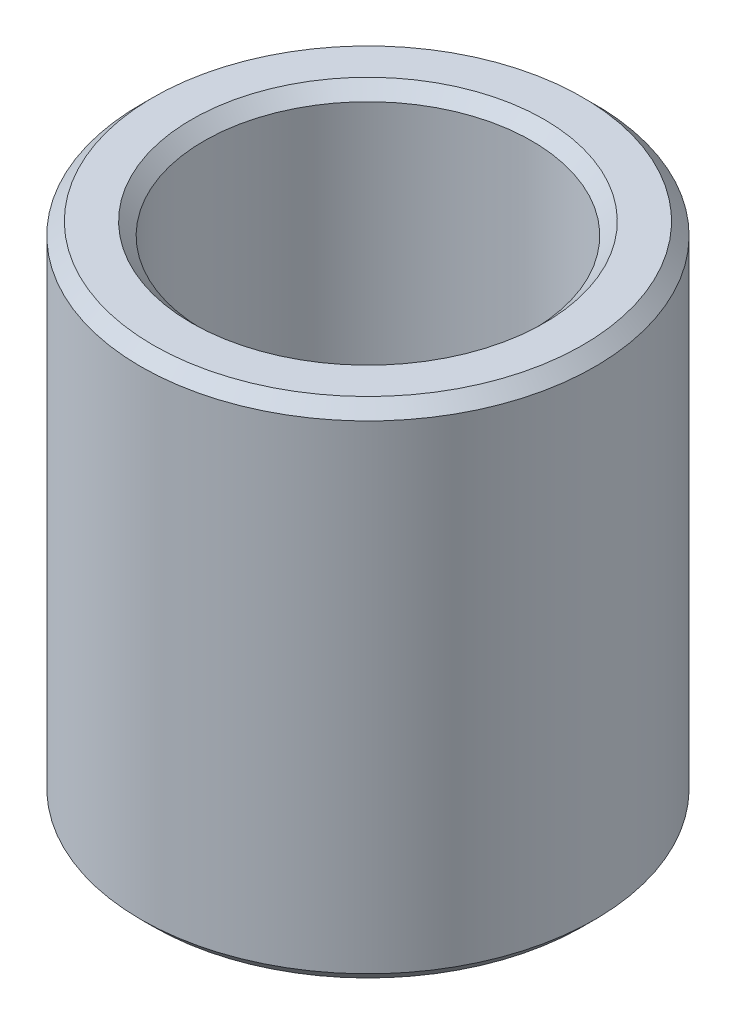
ISO-10303-21;
HEADER;
FILE_DESCRIPTION(('STEP AP214'),'2;1');
FILE_NAME('part.step','',(''),(''),'','','');
FILE_SCHEMA(('AUTOMOTIVE_DESIGN { 1 0 10303 214 1 1 1 1 }'));
ENDSEC;
DATA;
#1=APPLICATION_CONTEXT('core data for automotive mechanical design processes');
#2=APPLICATION_PROTOCOL_DEFINITION('international standard','automotive_design',2000,#1);
#3=PRODUCT_CONTEXT('',#1,'mechanical');
#4=PRODUCT('Part','Part','',(#3));
#5=PRODUCT_RELATED_PRODUCT_CATEGORY('part','',(#4));
#6=PRODUCT_DEFINITION_FORMATION('','',#4);
#7=PRODUCT_DEFINITION_CONTEXT('part definition',#1,'design');
#8=PRODUCT_DEFINITION('design','',#6,#7);
#9=PRODUCT_DEFINITION_SHAPE('','',#8);
#10=(LENGTH_UNIT() NAMED_UNIT(*) SI_UNIT(.MILLI.,.METRE.));
#11=(NAMED_UNIT(*) PLANE_ANGLE_UNIT() SI_UNIT($,.RADIAN.));
#12=(NAMED_UNIT(*) SI_UNIT($,.STERADIAN.) SOLID_ANGLE_UNIT());
#13=UNCERTAINTY_MEASURE_WITH_UNIT(LENGTH_MEASURE(1.E-05),#10,'distance_accuracy_value','');
#14=(GEOMETRIC_REPRESENTATION_CONTEXT(3) GLOBAL_UNCERTAINTY_ASSIGNED_CONTEXT((#13)) GLOBAL_UNIT_ASSIGNED_CONTEXT((#10,
#11,#12)) REPRESENTATION_CONTEXT('',''));
#15=CARTESIAN_POINT('',(0.,0.,0.));
#16=DIRECTION('',(0.,0.,1.));
#17=DIRECTION('',(1.,0.,0.));
#18=AXIS2_PLACEMENT_3D('',#15,#16,#17);
#19=CARTESIAN_POINT('',(0.,110.86842726317,0.));
#20=DIRECTION('',(0.,-1.,0.));
#21=DIRECTION('',(0.,0.,-1.));
#22=AXIS2_PLACEMENT_3D('',#19,#20,#21);
#23=CYLINDRICAL_SURFACE('',#22,50.);
#24=CARTESIAN_POINT('',(0.,2.73152346161752,0.));
#25=DIRECTION('',(0.,1.,0.));
#26=DIRECTION('',(0.,0.,1.));
#27=AXIS2_PLACEMENT_3D('',#24,#25,#26);
#28=CIRCLE('',#27,50.);
#29=CARTESIAN_POINT('',(0.,2.73152346161752,50.));
#30=VERTEX_POINT('',#29);
#31=EDGE_CURVE('E10',#30,#30,#28,.T.);
#32=ORIENTED_EDGE('',*,*,#31,.T.);
#33=EDGE_LOOP('',(#32));
#34=FACE_BOUND('',#33,.T.);
#35=CARTESIAN_POINT('',(0.,108.136903801553,0.));
#36=DIRECTION('',(0.,1.,0.));
#37=DIRECTION('',(0.,0.,1.));
#38=AXIS2_PLACEMENT_3D('',#35,#36,#37);
#39=CIRCLE('',#38,50.);
#40=CARTESIAN_POINT('',(0.,108.136903801553,50.));
#41=VERTEX_POINT('',#40);
#42=EDGE_CURVE('E50',#41,#41,#39,.F.);
#43=ORIENTED_EDGE('',*,*,#42,.T.);
#44=EDGE_LOOP('',(#43));
#45=FACE_BOUND('',#44,.T.);
#46=ADVANCED_FACE('F39',(#34,#45),#23,.T.);
#47=CARTESIAN_POINT('',(0.,110.86842726317,0.));
#48=DIRECTION('',(0.,1.,0.));
#49=DIRECTION('',(0.,0.,1.));
#50=AXIS2_PLACEMENT_3D('',#47,#48,#49);
#51=PLANE('',#50);
#52=CARTESIAN_POINT('',(0.,110.86842726317,0.));
#53=DIRECTION('',(0.,1.,0.));
#54=DIRECTION('',(0.,0.,1.));
#55=AXIS2_PLACEMENT_3D('',#52,#53,#54);
#56=CIRCLE('',#55,38.8234910471051);
#57=CARTESIAN_POINT('',(0.,110.86842726317,38.8234910471051));
#58=VERTEX_POINT('',#57);
#59=EDGE_CURVE('E58',#58,#58,#56,.F.);
#60=ORIENTED_EDGE('',*,*,#59,.T.);
#61=EDGE_LOOP('',(#60));
#62=FACE_BOUND('',#61,.T.);
#63=CARTESIAN_POINT('',(0.,110.86842726317,0.));
#64=DIRECTION('',(0.,1.,0.));
#65=DIRECTION('',(0.,0.,1.));
#66=AXIS2_PLACEMENT_3D('',#63,#64,#65);
#67=CIRCLE('',#66,47.2684765383825);
#68=CARTESIAN_POINT('',(0.,110.86842726317,47.2684765383825));
#69=VERTEX_POINT('',#68);
#70=EDGE_CURVE('E61',#69,#69,#67,.T.);
#71=ORIENTED_EDGE('',*,*,#70,.T.);
#72=EDGE_LOOP('',(#71));
#73=FACE_BOUND('',#72,.T.);
#74=ADVANCED_FACE('F88',(#62,#73),#51,.T.);
#75=CARTESIAN_POINT('',(0.,0.,0.));
#76=DIRECTION('',(0.,1.,0.));
#77=DIRECTION('',(0.,0.,1.));
#78=AXIS2_PLACEMENT_3D('',#75,#76,#77);
#79=PLANE('',#78);
#80=CARTESIAN_POINT('',(0.,0.,0.));
#81=DIRECTION('',(0.,1.,0.));
#82=DIRECTION('',(0.,0.,1.));
#83=AXIS2_PLACEMENT_3D('',#80,#81,#82);
#84=CIRCLE('',#83,38.8234910471051);
#85=CARTESIAN_POINT('',(0.,0.,38.8234910471051));
#86=VERTEX_POINT('',#85);
#87=EDGE_CURVE('E51',#86,#86,#84,.T.);
#88=ORIENTED_EDGE('',*,*,#87,.T.);
#89=EDGE_LOOP('',(#88));
#90=FACE_BOUND('',#89,.T.);
#91=CARTESIAN_POINT('',(0.,0.,0.));
#92=DIRECTION('',(0.,1.,0.));
#93=DIRECTION('',(0.,0.,1.));
#94=AXIS2_PLACEMENT_3D('',#91,#92,#93);
#95=CIRCLE('',#94,47.2684765383825);
#96=CARTESIAN_POINT('',(0.,0.,47.2684765383825));
#97=VERTEX_POINT('',#96);
#98=EDGE_CURVE('E54',#97,#97,#95,.F.);
#99=ORIENTED_EDGE('',*,*,#98,.T.);
#100=EDGE_LOOP('',(#99));
#101=FACE_BOUND('',#100,.T.);
#102=ADVANCED_FACE('F83',(#90,#101),#79,.F.);
#103=CARTESIAN_POINT('',(0.,110.86842726317,0.));
#104=DIRECTION('',(0.,-1.,0.));
#105=DIRECTION('',(0.,0.,-1.));
#106=AXIS2_PLACEMENT_3D('',#103,#104,#105);
#107=CYLINDRICAL_SURFACE('',#106,36.0919675854875);
#108=CARTESIAN_POINT('',(0.,108.136903801553,0.));
#109=DIRECTION('',(0.,1.,0.));
#110=DIRECTION('',(0.,0.,1.));
#111=AXIS2_PLACEMENT_3D('',#108,#109,#110);
#112=CIRCLE('',#111,36.0919675854875);
#113=CARTESIAN_POINT('',(0.,108.136903801553,36.0919675854875));
#114=VERTEX_POINT('',#113);
#115=EDGE_CURVE('E67',#114,#114,#112,.T.);
#116=ORIENTED_EDGE('',*,*,#115,.T.);
#117=EDGE_LOOP('',(#116));
#118=FACE_BOUND('',#117,.T.);
#119=CARTESIAN_POINT('',(0.,2.73152346161754,0.));
#120=DIRECTION('',(0.,1.,0.));
#121=DIRECTION('',(0.,0.,1.));
#122=AXIS2_PLACEMENT_3D('',#119,#120,#121);
#123=CIRCLE('',#122,36.0919675854875);
#124=CARTESIAN_POINT('',(0.,2.73152346161754,36.0919675854875));
#125=VERTEX_POINT('',#124);
#126=EDGE_CURVE('E69',#125,#125,#123,.F.);
#127=ORIENTED_EDGE('',*,*,#126,.T.);
#128=EDGE_LOOP('',(#127));
#129=FACE_BOUND('',#128,.T.);
#130=ADVANCED_FACE('F71',(#118,#129),#107,.F.);
#131=CARTESIAN_POINT('',(0.,108.136903801553,0.));
#132=DIRECTION('',(0.,1.,0.));
#133=DIRECTION('',(0.,0.,1.));
#134=AXIS2_PLACEMENT_3D('',#131,#132,#133);
#135=CONICAL_SURFACE('',#134,36.0919675854875,0.785398163397453);
#136=ORIENTED_EDGE('',*,*,#59,.F.);
#137=EDGE_LOOP('',(#136));
#138=FACE_BOUND('',#137,.T.);
#139=ORIENTED_EDGE('',*,*,#115,.F.);
#140=EDGE_LOOP('',(#139));
#141=FACE_BOUND('',#140,.T.);
#142=ADVANCED_FACE('F77',(#138,#141),#135,.F.);
#143=CARTESIAN_POINT('',(0.,0.,0.));
#144=DIRECTION('',(0.,-1.,0.));
#145=DIRECTION('',(0.,0.,-1.));
#146=AXIS2_PLACEMENT_3D('',#143,#144,#145);
#147=CONICAL_SURFACE('',#146,38.8234910471051,0.785398163397448);
#148=ORIENTED_EDGE('',*,*,#126,.F.);
#149=EDGE_LOOP('',(#148));
#150=FACE_BOUND('',#149,.T.);
#151=ORIENTED_EDGE('',*,*,#87,.F.);
#152=EDGE_LOOP('',(#151));
#153=FACE_BOUND('',#152,.T.);
#154=ADVANCED_FACE('F73',(#150,#153),#147,.F.);
#155=CARTESIAN_POINT('',(0.,2.73152346161752,0.));
#156=DIRECTION('',(0.,1.,0.));
#157=DIRECTION('',(0.,0.,1.));
#158=AXIS2_PLACEMENT_3D('',#155,#156,#157);
#159=CONICAL_SURFACE('',#158,50.,0.78539816339745);
#160=ORIENTED_EDGE('',*,*,#98,.F.);
#161=EDGE_LOOP('',(#160));
#162=FACE_BOUND('',#161,.T.);
#163=ORIENTED_EDGE('',*,*,#31,.F.);
#164=EDGE_LOOP('',(#163));
#165=FACE_BOUND('',#164,.T.);
#166=ADVANCED_FACE('F76',(#162,#165),#159,.T.);
#167=CARTESIAN_POINT('',(0.,110.86842726317,0.));
#168=DIRECTION('',(0.,-1.,0.));
#169=DIRECTION('',(0.,0.,-1.));
#170=AXIS2_PLACEMENT_3D('',#167,#168,#169);
#171=CONICAL_SURFACE('',#170,47.2684765383825,0.785398163397448);
#172=ORIENTED_EDGE('',*,*,#42,.F.);
#173=EDGE_LOOP('',(#172));
#174=FACE_BOUND('',#173,.T.);
#175=ORIENTED_EDGE('',*,*,#70,.F.);
#176=EDGE_LOOP('',(#175));
#177=FACE_BOUND('',#176,.T.);
#178=ADVANCED_FACE('F45',(#174,#177),#171,.T.);
#179=CLOSED_SHELL('',(#46,#74,#102,#130,#142,#154,#166,#178));
#180=MANIFOLD_SOLID_BREP('B2',#179);
#181=ADVANCED_BREP_SHAPE_REPRESENTATION('',(#18,#180),#14);
#182=SHAPE_DEFINITION_REPRESENTATION(#9,#181);
ENDSEC;
END-ISO-10303-21;
